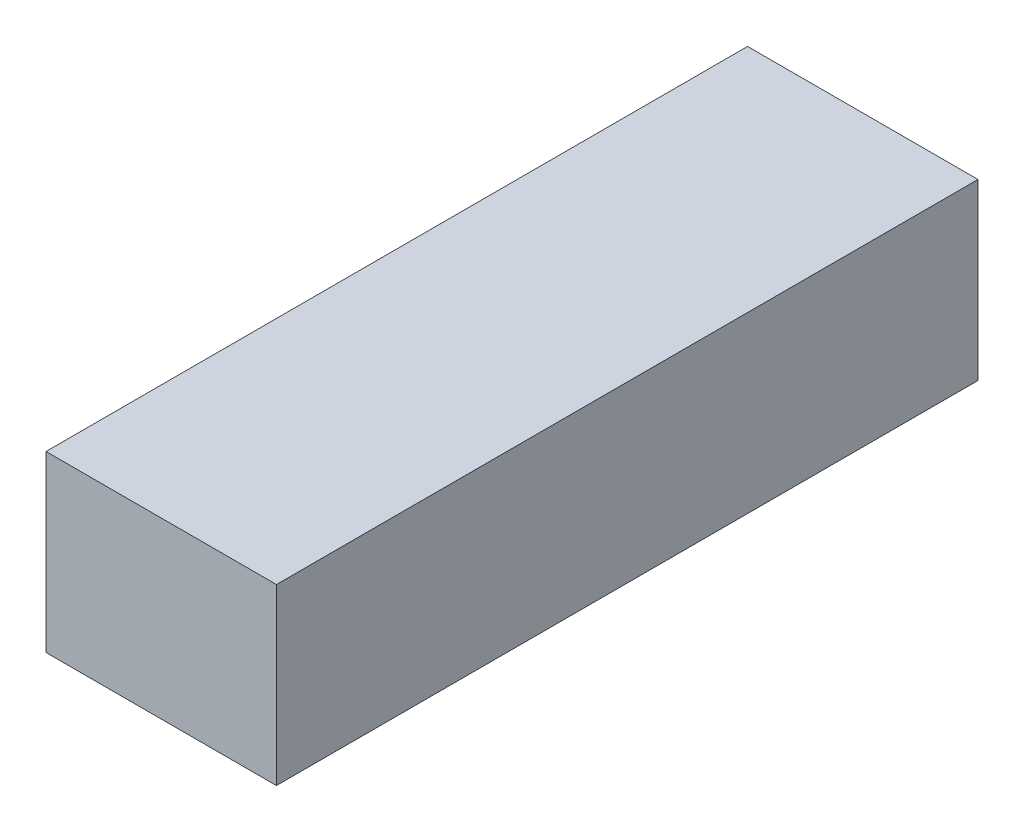
ISO-10303-21;
HEADER;
FILE_DESCRIPTION(('STEP AP214'),'2;1');
FILE_NAME('part.step','',(''),(''),'','','');
FILE_SCHEMA(('AUTOMOTIVE_DESIGN { 1 0 10303 214 1 1 1 1 }'));
ENDSEC;
DATA;
#1=APPLICATION_CONTEXT('core data for automotive mechanical design processes');
#2=APPLICATION_PROTOCOL_DEFINITION('international standard','automotive_design',2000,#1);
#3=PRODUCT_CONTEXT('',#1,'mechanical');
#4=PRODUCT('Part','Part','',(#3));
#5=PRODUCT_RELATED_PRODUCT_CATEGORY('part','',(#4));
#6=PRODUCT_DEFINITION_FORMATION('','',#4);
#7=PRODUCT_DEFINITION_CONTEXT('part definition',#1,'design');
#8=PRODUCT_DEFINITION('design','',#6,#7);
#9=PRODUCT_DEFINITION_SHAPE('','',#8);
#10=(LENGTH_UNIT() NAMED_UNIT(*) SI_UNIT(.MILLI.,.METRE.));
#11=(NAMED_UNIT(*) PLANE_ANGLE_UNIT() SI_UNIT($,.RADIAN.));
#12=(NAMED_UNIT(*) SI_UNIT($,.STERADIAN.) SOLID_ANGLE_UNIT());
#13=UNCERTAINTY_MEASURE_WITH_UNIT(LENGTH_MEASURE(1.E-05),#10,'distance_accuracy_value','');
#14=(GEOMETRIC_REPRESENTATION_CONTEXT(3) GLOBAL_UNCERTAINTY_ASSIGNED_CONTEXT((#13)) GLOBAL_UNIT_ASSIGNED_CONTEXT((#10,
#11,#12)) REPRESENTATION_CONTEXT('',''));
#15=CARTESIAN_POINT('',(0.,0.,0.));
#16=DIRECTION('',(0.,0.,1.));
#17=DIRECTION('',(1.,0.,0.));
#18=AXIS2_PLACEMENT_3D('',#15,#16,#17);
#19=CARTESIAN_POINT('',(22.5,-17.,137.));
#20=DIRECTION('',(-1.,0.,0.));
#21=DIRECTION('',(0.,0.,1.));
#22=AXIS2_PLACEMENT_3D('',#19,#20,#21);
#23=PLANE('',#22);
#24=DIRECTION('',(0.,1.,0.));
#25=VECTOR('',#24,1.);
#26=CARTESIAN_POINT('',(22.5,-17.,0.));
#27=LINE('',#26,#25);
#28=CARTESIAN_POINT('',(22.5,-17.,0.));
#29=VERTEX_POINT('',#28);
#30=CARTESIAN_POINT('',(22.5,17.,0.));
#31=VERTEX_POINT('',#30);
#32=EDGE_CURVE('E96',#29,#31,#27,.T.);
#33=ORIENTED_EDGE('',*,*,#32,.T.);
#34=DIRECTION('',(0.,0.,-1.));
#35=VECTOR('',#34,1.);
#36=CARTESIAN_POINT('',(22.5,17.,137.));
#37=LINE('',#36,#35);
#38=CARTESIAN_POINT('',(22.5,17.,137.));
#39=VERTEX_POINT('',#38);
#40=EDGE_CURVE('E11',#39,#31,#37,.T.);
#41=ORIENTED_EDGE('',*,*,#40,.F.);
#42=DIRECTION('',(0.,1.,0.));
#43=VECTOR('',#42,1.);
#44=CARTESIAN_POINT('',(22.5,-17.,137.));
#45=LINE('',#44,#43);
#46=CARTESIAN_POINT('',(22.5,-17.,137.));
#47=VERTEX_POINT('',#46);
#48=EDGE_CURVE('E84',#47,#39,#45,.T.);
#49=ORIENTED_EDGE('',*,*,#48,.F.);
#50=DIRECTION('',(0.,0.,-1.));
#51=VECTOR('',#50,1.);
#52=CARTESIAN_POINT('',(22.5,-17.,137.));
#53=LINE('',#52,#51);
#54=EDGE_CURVE('E92',#47,#29,#53,.T.);
#55=ORIENTED_EDGE('',*,*,#54,.T.);
#56=EDGE_LOOP('',(#33,#41,#49,#55));
#57=FACE_BOUND('',#56,.T.);
#58=ADVANCED_FACE('F33',(#57),#23,.F.);
#59=CARTESIAN_POINT('',(-22.5,17.,137.));
#60=DIRECTION('',(0.,-1.,0.));
#61=DIRECTION('',(0.,0.,-1.));
#62=AXIS2_PLACEMENT_3D('',#59,#60,#61);
#63=PLANE('',#62);
#64=DIRECTION('',(-1.,0.,0.));
#65=VECTOR('',#64,1.);
#66=CARTESIAN_POINT('',(-22.5,17.,0.));
#67=LINE('',#66,#65);
#68=CARTESIAN_POINT('',(-22.5,17.,0.));
#69=VERTEX_POINT('',#68);
#70=EDGE_CURVE('E88',#31,#69,#67,.T.);
#71=ORIENTED_EDGE('',*,*,#70,.T.);
#72=DIRECTION('',(0.,0.,-1.));
#73=VECTOR('',#72,1.);
#74=CARTESIAN_POINT('',(-22.5,17.,137.));
#75=LINE('',#74,#73);
#76=CARTESIAN_POINT('',(-22.5,17.,137.));
#77=VERTEX_POINT('',#76);
#78=EDGE_CURVE('E41',#77,#69,#75,.T.);
#79=ORIENTED_EDGE('',*,*,#78,.F.);
#80=DIRECTION('',(-1.,0.,0.));
#81=VECTOR('',#80,1.);
#82=CARTESIAN_POINT('',(-22.5,17.,137.));
#83=LINE('',#82,#81);
#84=EDGE_CURVE('E79',#39,#77,#83,.T.);
#85=ORIENTED_EDGE('',*,*,#84,.F.);
#86=ORIENTED_EDGE('',*,*,#40,.T.);
#87=EDGE_LOOP('',(#71,#79,#85,#86));
#88=FACE_BOUND('',#87,.T.);
#89=ADVANCED_FACE('F87',(#88),#63,.F.);
#90=CARTESIAN_POINT('',(-22.5,-17.,137.));
#91=DIRECTION('',(1.,0.,0.));
#92=DIRECTION('',(0.,0.,-1.));
#93=AXIS2_PLACEMENT_3D('',#90,#91,#92);
#94=PLANE('',#93);
#95=DIRECTION('',(0.,-1.,0.));
#96=VECTOR('',#95,1.);
#97=CARTESIAN_POINT('',(-22.5,-17.,0.));
#98=LINE('',#97,#96);
#99=CARTESIAN_POINT('',(-22.5,-17.,0.));
#100=VERTEX_POINT('',#99);
#101=EDGE_CURVE('E66',#69,#100,#98,.T.);
#102=ORIENTED_EDGE('',*,*,#101,.T.);
#103=DIRECTION('',(0.,0.,-1.));
#104=VECTOR('',#103,1.);
#105=CARTESIAN_POINT('',(-22.5,-17.,137.));
#106=LINE('',#105,#104);
#107=CARTESIAN_POINT('',(-22.5,-17.,137.));
#108=VERTEX_POINT('',#107);
#109=EDGE_CURVE('E89',#108,#100,#106,.T.);
#110=ORIENTED_EDGE('',*,*,#109,.F.);
#111=DIRECTION('',(0.,-1.,0.));
#112=VECTOR('',#111,1.);
#113=CARTESIAN_POINT('',(-22.5,-17.,137.));
#114=LINE('',#113,#112);
#115=EDGE_CURVE('E82',#77,#108,#114,.T.);
#116=ORIENTED_EDGE('',*,*,#115,.F.);
#117=ORIENTED_EDGE('',*,*,#78,.T.);
#118=EDGE_LOOP('',(#102,#110,#116,#117));
#119=FACE_BOUND('',#118,.T.);
#120=ADVANCED_FACE('F90',(#119),#94,.F.);
#121=CARTESIAN_POINT('',(-22.5,-17.,137.));
#122=DIRECTION('',(0.,1.,0.));
#123=DIRECTION('',(0.,0.,1.));
#124=AXIS2_PLACEMENT_3D('',#121,#122,#123);
#125=PLANE('',#124);
#126=DIRECTION('',(1.,0.,0.));
#127=VECTOR('',#126,1.);
#128=CARTESIAN_POINT('',(-22.5,-17.,0.));
#129=LINE('',#128,#127);
#130=EDGE_CURVE('E72',#100,#29,#129,.T.);
#131=ORIENTED_EDGE('',*,*,#130,.T.);
#132=ORIENTED_EDGE('',*,*,#54,.F.);
#133=DIRECTION('',(1.,0.,0.));
#134=VECTOR('',#133,1.);
#135=CARTESIAN_POINT('',(-22.5,-17.,137.));
#136=LINE('',#135,#134);
#137=EDGE_CURVE('E49',#108,#47,#136,.T.);
#138=ORIENTED_EDGE('',*,*,#137,.F.);
#139=ORIENTED_EDGE('',*,*,#109,.T.);
#140=EDGE_LOOP('',(#131,#132,#138,#139));
#141=FACE_BOUND('',#140,.T.);
#142=ADVANCED_FACE('F103',(#141),#125,.F.);
#143=CARTESIAN_POINT('',(0.,0.,137.));
#144=DIRECTION('',(0.,0.,-1.));
#145=DIRECTION('',(-1.,0.,0.));
#146=AXIS2_PLACEMENT_3D('',#143,#144,#145);
#147=PLANE('',#146);
#148=ORIENTED_EDGE('',*,*,#48,.T.);
#149=ORIENTED_EDGE('',*,*,#84,.T.);
#150=ORIENTED_EDGE('',*,*,#115,.T.);
#151=ORIENTED_EDGE('',*,*,#137,.T.);
#152=EDGE_LOOP('',(#148,#149,#150,#151));
#153=FACE_BOUND('',#152,.T.);
#154=ADVANCED_FACE('F80',(#153),#147,.F.);
#155=CARTESIAN_POINT('',(0.,0.,0.));
#156=DIRECTION('',(0.,0.,-1.));
#157=DIRECTION('',(-1.,0.,0.));
#158=AXIS2_PLACEMENT_3D('',#155,#156,#157);
#159=PLANE('',#158);
#160=ORIENTED_EDGE('',*,*,#32,.F.);
#161=ORIENTED_EDGE('',*,*,#130,.F.);
#162=ORIENTED_EDGE('',*,*,#101,.F.);
#163=ORIENTED_EDGE('',*,*,#70,.F.);
#164=EDGE_LOOP('',(#160,#161,#162,#163));
#165=FACE_BOUND('',#164,.T.);
#166=ADVANCED_FACE('F106',(#165),#159,.T.);
#167=CLOSED_SHELL('',(#58,#89,#120,#142,#154,#166));
#168=MANIFOLD_SOLID_BREP('B2',#167);
#169=ADVANCED_BREP_SHAPE_REPRESENTATION('',(#18,#168),#14);
#170=SHAPE_DEFINITION_REPRESENTATION(#9,#169);
ENDSEC;
END-ISO-10303-21;
